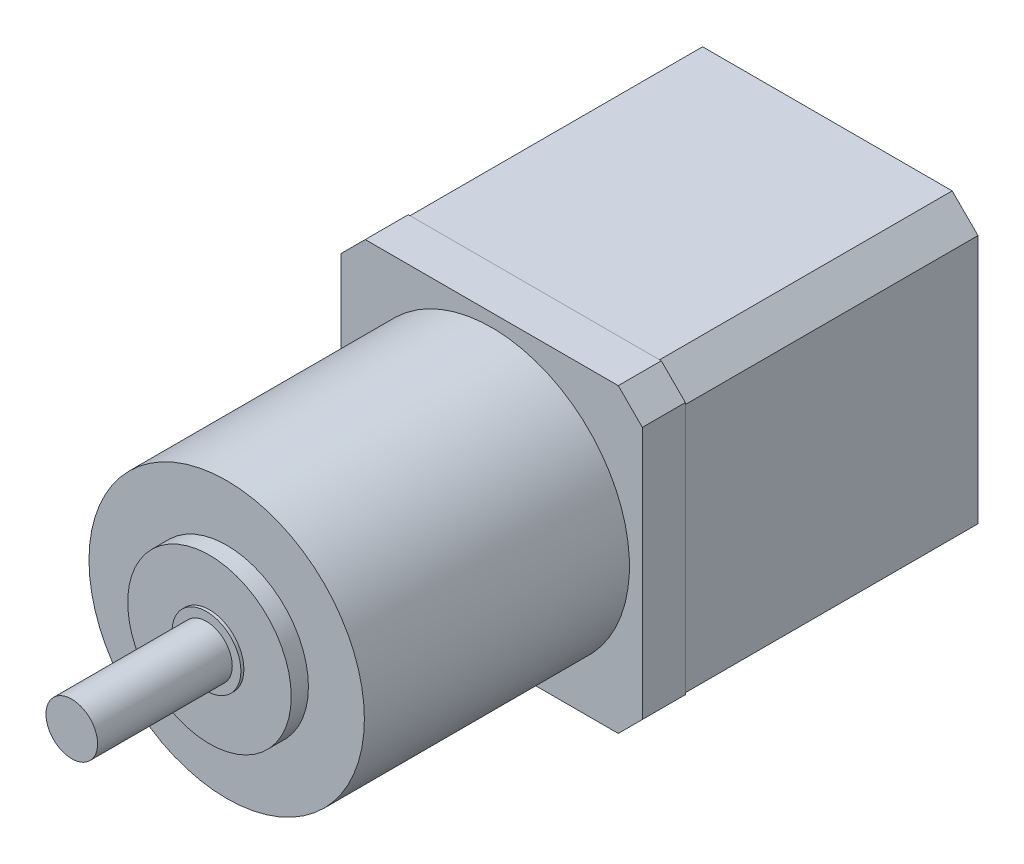
ISO-10303-21;
HEADER;
FILE_DESCRIPTION(('STEP AP214'),'2;1');
FILE_NAME('part.step','',(''),(''),'','','');
FILE_SCHEMA(('AUTOMOTIVE_DESIGN { 1 0 10303 214 1 1 1 1 }'));
ENDSEC;
DATA;
#1=APPLICATION_CONTEXT('core data for automotive mechanical design processes');
#2=APPLICATION_PROTOCOL_DEFINITION('international standard','automotive_design',2000,#1);
#3=PRODUCT_CONTEXT('',#1,'mechanical');
#4=PRODUCT('Part','Part','',(#3));
#5=PRODUCT_RELATED_PRODUCT_CATEGORY('part','',(#4));
#6=PRODUCT_DEFINITION_FORMATION('','',#4);
#7=PRODUCT_DEFINITION_CONTEXT('part definition',#1,'design');
#8=PRODUCT_DEFINITION('design','',#6,#7);
#9=PRODUCT_DEFINITION_SHAPE('','',#8);
#10=(LENGTH_UNIT() NAMED_UNIT(*) SI_UNIT(.MILLI.,.METRE.));
#11=(NAMED_UNIT(*) PLANE_ANGLE_UNIT() SI_UNIT($,.RADIAN.));
#12=(NAMED_UNIT(*) SI_UNIT($,.STERADIAN.) SOLID_ANGLE_UNIT());
#13=UNCERTAINTY_MEASURE_WITH_UNIT(LENGTH_MEASURE(1.E-05),#10,'distance_accuracy_value','');
#14=(GEOMETRIC_REPRESENTATION_CONTEXT(3) GLOBAL_UNCERTAINTY_ASSIGNED_CONTEXT((#13)) GLOBAL_UNIT_ASSIGNED_CONTEXT((#10,
#11,#12)) REPRESENTATION_CONTEXT('',''));
#15=CARTESIAN_POINT('',(0.,0.,0.));
#16=DIRECTION('',(0.,0.,1.));
#17=DIRECTION('',(1.,0.,0.));
#18=AXIS2_PLACEMENT_3D('',#15,#16,#17);
#19=CARTESIAN_POINT('',(17.5,-17.5,39.));
#20=DIRECTION('',(-1.,0.,0.));
#21=DIRECTION('',(0.,0.,1.));
#22=AXIS2_PLACEMENT_3D('',#19,#20,#21);
#23=PLANE('',#22);
#24=DIRECTION('',(0.,1.,0.));
#25=VECTOR('',#24,1.);
#26=CARTESIAN_POINT('',(17.5,-17.5,39.));
#27=LINE('',#26,#25);
#28=CARTESIAN_POINT('',(17.5,-14.7,39.));
#29=VERTEX_POINT('',#28);
#30=CARTESIAN_POINT('',(17.5,14.7,39.));
#31=VERTEX_POINT('',#30);
#32=EDGE_CURVE('E139',#29,#31,#27,.T.);
#33=ORIENTED_EDGE('',*,*,#32,.F.);
#34=DIRECTION('',(0.,0.,-1.));
#35=VECTOR('',#34,1.);
#36=CARTESIAN_POINT('',(17.5,-14.7,39.));
#37=LINE('',#36,#35);
#38=CARTESIAN_POINT('',(17.5,-14.7,34.));
#39=VERTEX_POINT('',#38);
#40=EDGE_CURVE('E165',#29,#39,#37,.T.);
#41=ORIENTED_EDGE('',*,*,#40,.T.);
#42=DIRECTION('',(0.,1.,0.));
#43=VECTOR('',#42,1.);
#44=CARTESIAN_POINT('',(17.5,-17.5,34.));
#45=LINE('',#44,#43);
#46=CARTESIAN_POINT('',(17.5,14.7,34.));
#47=VERTEX_POINT('',#46);
#48=EDGE_CURVE('E176',#39,#47,#45,.T.);
#49=ORIENTED_EDGE('',*,*,#48,.T.);
#50=DIRECTION('',(0.,0.,1.));
#51=VECTOR('',#50,1.);
#52=CARTESIAN_POINT('',(17.5,14.7,39.));
#53=LINE('',#52,#51);
#54=EDGE_CURVE('E163',#47,#31,#53,.T.);
#55=ORIENTED_EDGE('',*,*,#54,.T.);
#56=EDGE_LOOP('',(#33,#41,#49,#55));
#57=FACE_BOUND('',#56,.T.);
#58=ADVANCED_FACE('F46',(#57),#23,.F.);
#59=CARTESIAN_POINT('',(-17.5,17.5,39.));
#60=DIRECTION('',(0.,-1.,0.));
#61=DIRECTION('',(0.,0.,-1.));
#62=AXIS2_PLACEMENT_3D('',#59,#60,#61);
#63=PLANE('',#62);
#64=DIRECTION('',(-1.,0.,0.));
#65=VECTOR('',#64,1.);
#66=CARTESIAN_POINT('',(-17.5,17.5,34.));
#67=LINE('',#66,#65);
#68=CARTESIAN_POINT('',(14.7,17.5,34.));
#69=VERTEX_POINT('',#68);
#70=CARTESIAN_POINT('',(-14.7,17.5,34.));
#71=VERTEX_POINT('',#70);
#72=EDGE_CURVE('E144',#69,#71,#67,.T.);
#73=ORIENTED_EDGE('',*,*,#72,.T.);
#74=DIRECTION('',(0.,0.,1.));
#75=VECTOR('',#74,1.);
#76=CARTESIAN_POINT('',(-14.7,17.5,39.));
#77=LINE('',#76,#75);
#78=CARTESIAN_POINT('',(-14.7,17.5,39.));
#79=VERTEX_POINT('',#78);
#80=EDGE_CURVE('E55',#71,#79,#77,.T.);
#81=ORIENTED_EDGE('',*,*,#80,.T.);
#82=DIRECTION('',(-1.,0.,0.));
#83=VECTOR('',#82,1.);
#84=CARTESIAN_POINT('',(-17.5,17.5,39.));
#85=LINE('',#84,#83);
#86=CARTESIAN_POINT('',(14.7,17.5,39.));
#87=VERTEX_POINT('',#86);
#88=EDGE_CURVE('E142',#87,#79,#85,.T.);
#89=ORIENTED_EDGE('',*,*,#88,.F.);
#90=DIRECTION('',(0.,0.,-1.));
#91=VECTOR('',#90,1.);
#92=CARTESIAN_POINT('',(14.7,17.5,39.));
#93=LINE('',#92,#91);
#94=EDGE_CURVE('E168',#87,#69,#93,.T.);
#95=ORIENTED_EDGE('',*,*,#94,.T.);
#96=EDGE_LOOP('',(#73,#81,#89,#95));
#97=FACE_BOUND('',#96,.T.);
#98=ADVANCED_FACE('F173',(#97),#63,.F.);
#99=CARTESIAN_POINT('',(-17.5,-17.5,39.));
#100=DIRECTION('',(1.,0.,0.));
#101=DIRECTION('',(0.,0.,-1.));
#102=AXIS2_PLACEMENT_3D('',#99,#100,#101);
#103=PLANE('',#102);
#104=DIRECTION('',(0.,-1.,0.));
#105=VECTOR('',#104,1.);
#106=CARTESIAN_POINT('',(-17.5,-17.5,34.));
#107=LINE('',#106,#105);
#108=CARTESIAN_POINT('',(-17.5,14.7,34.));
#109=VERTEX_POINT('',#108);
#110=CARTESIAN_POINT('',(-17.5,-14.7,34.));
#111=VERTEX_POINT('',#110);
#112=EDGE_CURVE('E140',#109,#111,#107,.T.);
#113=ORIENTED_EDGE('',*,*,#112,.T.);
#114=DIRECTION('',(0.,0.,1.));
#115=VECTOR('',#114,1.);
#116=CARTESIAN_POINT('',(-17.5,-14.7,39.));
#117=LINE('',#116,#115);
#118=CARTESIAN_POINT('',(-17.5,-14.7,39.));
#119=VERTEX_POINT('',#118);
#120=EDGE_CURVE('E118',#111,#119,#117,.T.);
#121=ORIENTED_EDGE('',*,*,#120,.T.);
#122=DIRECTION('',(0.,-1.,0.));
#123=VECTOR('',#122,1.);
#124=CARTESIAN_POINT('',(-17.5,-17.5,39.));
#125=LINE('',#124,#123);
#126=CARTESIAN_POINT('',(-17.5,14.7,39.));
#127=VERTEX_POINT('',#126);
#128=EDGE_CURVE('E181',#127,#119,#125,.T.);
#129=ORIENTED_EDGE('',*,*,#128,.F.);
#130=DIRECTION('',(0.,0.,-1.));
#131=VECTOR('',#130,1.);
#132=CARTESIAN_POINT('',(-17.5,14.7,39.));
#133=LINE('',#132,#131);
#134=EDGE_CURVE('E123',#127,#109,#133,.T.);
#135=ORIENTED_EDGE('',*,*,#134,.T.);
#136=EDGE_LOOP('',(#113,#121,#129,#135));
#137=FACE_BOUND('',#136,.T.);
#138=ADVANCED_FACE('F229',(#137),#103,.F.);
#139=CARTESIAN_POINT('',(-17.5,-17.5,39.));
#140=DIRECTION('',(0.,1.,0.));
#141=DIRECTION('',(0.,0.,1.));
#142=AXIS2_PLACEMENT_3D('',#139,#140,#141);
#143=PLANE('',#142);
#144=DIRECTION('',(1.,0.,0.));
#145=VECTOR('',#144,1.);
#146=CARTESIAN_POINT('',(-17.5,-17.5,39.));
#147=LINE('',#146,#145);
#148=CARTESIAN_POINT('',(-14.7,-17.5,39.));
#149=VERTEX_POINT('',#148);
#150=CARTESIAN_POINT('',(14.7,-17.5,39.));
#151=VERTEX_POINT('',#150);
#152=EDGE_CURVE('E133',#149,#151,#147,.T.);
#153=ORIENTED_EDGE('',*,*,#152,.F.);
#154=DIRECTION('',(0.,0.,-1.));
#155=VECTOR('',#154,1.);
#156=CARTESIAN_POINT('',(-14.7,-17.5,39.));
#157=LINE('',#156,#155);
#158=CARTESIAN_POINT('',(-14.7,-17.5,34.));
#159=VERTEX_POINT('',#158);
#160=EDGE_CURVE('E117',#149,#159,#157,.T.);
#161=ORIENTED_EDGE('',*,*,#160,.T.);
#162=DIRECTION('',(1.,0.,0.));
#163=VECTOR('',#162,1.);
#164=CARTESIAN_POINT('',(-17.5,-17.5,34.));
#165=LINE('',#164,#163);
#166=CARTESIAN_POINT('',(14.7,-17.5,34.));
#167=VERTEX_POINT('',#166);
#168=EDGE_CURVE('E130',#159,#167,#165,.T.);
#169=ORIENTED_EDGE('',*,*,#168,.T.);
#170=DIRECTION('',(0.,0.,1.));
#171=VECTOR('',#170,1.);
#172=CARTESIAN_POINT('',(14.7,-17.5,39.));
#173=LINE('',#172,#171);
#174=EDGE_CURVE('E135',#167,#151,#173,.T.);
#175=ORIENTED_EDGE('',*,*,#174,.T.);
#176=EDGE_LOOP('',(#153,#161,#169,#175));
#177=FACE_BOUND('',#176,.T.);
#178=ADVANCED_FACE('F129',(#177),#143,.F.);
#179=CARTESIAN_POINT('',(0.,0.,39.));
#180=DIRECTION('',(0.,0.,-1.));
#181=DIRECTION('',(-1.,0.,0.));
#182=AXIS2_PLACEMENT_3D('',#179,#180,#181);
#183=PLANE('',#182);
#184=CARTESIAN_POINT('',(0.,0.,39.));
#185=DIRECTION('',(0.,0.,-1.));
#186=DIRECTION('',(-1.,0.,0.));
#187=AXIS2_PLACEMENT_3D('',#184,#185,#186);
#188=CIRCLE('',#187,16.);
#189=CARTESIAN_POINT('',(-16.,0.,39.));
#190=VERTEX_POINT('',#189);
#191=EDGE_CURVE('E12',#190,#190,#188,.F.);
#192=ORIENTED_EDGE('',*,*,#191,.F.);
#193=EDGE_LOOP('',(#192));
#194=FACE_BOUND('',#193,.T.);
#195=ORIENTED_EDGE('',*,*,#128,.T.);
#196=DIRECTION('',(-0.707106781186547,0.707106781186548,0.));
#197=VECTOR('',#196,1.);
#198=CARTESIAN_POINT('',(-14.7,-17.5,39.));
#199=LINE('',#198,#197);
#200=EDGE_CURVE('E161',#119,#149,#199,.F.);
#201=ORIENTED_EDGE('',*,*,#200,.T.);
#202=ORIENTED_EDGE('',*,*,#152,.T.);
#203=DIRECTION('',(-0.707106781186548,-0.707106781186547,0.));
#204=VECTOR('',#203,1.);
#205=CARTESIAN_POINT('',(17.5,-14.7,39.));
#206=LINE('',#205,#204);
#207=EDGE_CURVE('E159',#151,#29,#206,.F.);
#208=ORIENTED_EDGE('',*,*,#207,.T.);
#209=ORIENTED_EDGE('',*,*,#32,.T.);
#210=DIRECTION('',(0.707106781186547,-0.707106781186548,0.));
#211=VECTOR('',#210,1.);
#212=CARTESIAN_POINT('',(14.7,17.5,39.));
#213=LINE('',#212,#211);
#214=EDGE_CURVE('E68',#31,#87,#213,.F.);
#215=ORIENTED_EDGE('',*,*,#214,.T.);
#216=ORIENTED_EDGE('',*,*,#88,.T.);
#217=DIRECTION('',(0.707106781186548,0.707106781186547,0.));
#218=VECTOR('',#217,1.);
#219=CARTESIAN_POINT('',(-17.5,14.7,39.));
#220=LINE('',#219,#218);
#221=EDGE_CURVE('E157',#79,#127,#220,.F.);
#222=ORIENTED_EDGE('',*,*,#221,.T.);
#223=EDGE_LOOP('',(#195,#201,#202,#208,#209,#215,#216,#222));
#224=FACE_BOUND('',#223,.T.);
#225=ADVANCED_FACE('F249',(#194,#224),#183,.F.);
#226=CARTESIAN_POINT('',(0.,0.,34.));
#227=DIRECTION('',(0.,0.,-1.));
#228=DIRECTION('',(-1.,0.,0.));
#229=AXIS2_PLACEMENT_3D('',#226,#227,#228);
#230=PLANE('',#229);
#231=ORIENTED_EDGE('',*,*,#168,.F.);
#232=DIRECTION('',(0.707106781186547,-0.707106781186548,0.));
#233=VECTOR('',#232,1.);
#234=CARTESIAN_POINT('',(-16.1,-16.1,34.));
#235=LINE('',#234,#233);
#236=EDGE_CURVE('E113',#159,#111,#235,.F.);
#237=ORIENTED_EDGE('',*,*,#236,.T.);
#238=ORIENTED_EDGE('',*,*,#112,.F.);
#239=DIRECTION('',(-0.707106781186548,-0.707106781186547,0.));
#240=VECTOR('',#239,1.);
#241=CARTESIAN_POINT('',(-16.1,16.1,34.));
#242=LINE('',#241,#240);
#243=EDGE_CURVE('E150',#109,#71,#242,.F.);
#244=ORIENTED_EDGE('',*,*,#243,.T.);
#245=ORIENTED_EDGE('',*,*,#72,.F.);
#246=DIRECTION('',(-0.707106781186547,0.707106781186548,0.));
#247=VECTOR('',#246,1.);
#248=CARTESIAN_POINT('',(16.1,16.1,34.));
#249=LINE('',#248,#247);
#250=EDGE_CURVE('E134',#69,#47,#249,.F.);
#251=ORIENTED_EDGE('',*,*,#250,.T.);
#252=ORIENTED_EDGE('',*,*,#48,.F.);
#253=DIRECTION('',(0.707106781186548,0.707106781186547,0.));
#254=VECTOR('',#253,1.);
#255=CARTESIAN_POINT('',(16.1,-16.1,34.));
#256=LINE('',#255,#254);
#257=EDGE_CURVE('E124',#39,#167,#256,.F.);
#258=ORIENTED_EDGE('',*,*,#257,.T.);
#259=EDGE_LOOP('',(#231,#237,#238,#244,#245,#251,#252,#258));
#260=FACE_BOUND('',#259,.T.);
#261=ADVANCED_FACE('F137',(#260),#230,.T.);
#262=CARTESIAN_POINT('',(-14.7,-17.5,39.));
#263=DIRECTION('',(0.707106781186548,0.707106781186547,0.));
#264=DIRECTION('',(0.,0.,-1.));
#265=AXIS2_PLACEMENT_3D('',#262,#263,#264);
#266=PLANE('',#265);
#267=ORIENTED_EDGE('',*,*,#200,.F.);
#268=ORIENTED_EDGE('',*,*,#120,.F.);
#269=ORIENTED_EDGE('',*,*,#236,.F.);
#270=ORIENTED_EDGE('',*,*,#160,.F.);
#271=EDGE_LOOP('',(#267,#268,#269,#270));
#272=FACE_BOUND('',#271,.T.);
#273=ADVANCED_FACE('F116',(#272),#266,.F.);
#274=CARTESIAN_POINT('',(17.5,-14.7,39.));
#275=DIRECTION('',(-0.707106781186547,0.707106781186548,0.));
#276=DIRECTION('',(0.,0.,-1.));
#277=AXIS2_PLACEMENT_3D('',#274,#275,#276);
#278=PLANE('',#277);
#279=ORIENTED_EDGE('',*,*,#207,.F.);
#280=ORIENTED_EDGE('',*,*,#174,.F.);
#281=ORIENTED_EDGE('',*,*,#257,.F.);
#282=ORIENTED_EDGE('',*,*,#40,.F.);
#283=EDGE_LOOP('',(#279,#280,#281,#282));
#284=FACE_BOUND('',#283,.T.);
#285=ADVANCED_FACE('F236',(#284),#278,.F.);
#286=CARTESIAN_POINT('',(-17.5,14.7,39.));
#287=DIRECTION('',(0.707106781186547,-0.707106781186548,0.));
#288=DIRECTION('',(0.,0.,-1.));
#289=AXIS2_PLACEMENT_3D('',#286,#287,#288);
#290=PLANE('',#289);
#291=ORIENTED_EDGE('',*,*,#221,.F.);
#292=ORIENTED_EDGE('',*,*,#80,.F.);
#293=ORIENTED_EDGE('',*,*,#243,.F.);
#294=ORIENTED_EDGE('',*,*,#134,.F.);
#295=EDGE_LOOP('',(#291,#292,#293,#294));
#296=FACE_BOUND('',#295,.T.);
#297=ADVANCED_FACE('F238',(#296),#290,.F.);
#298=CARTESIAN_POINT('',(14.7,17.5,39.));
#299=DIRECTION('',(-0.707106781186548,-0.707106781186547,0.));
#300=DIRECTION('',(0.,0.,-1.));
#301=AXIS2_PLACEMENT_3D('',#298,#299,#300);
#302=PLANE('',#301);
#303=ORIENTED_EDGE('',*,*,#214,.F.);
#304=ORIENTED_EDGE('',*,*,#54,.F.);
#305=ORIENTED_EDGE('',*,*,#250,.F.);
#306=ORIENTED_EDGE('',*,*,#94,.F.);
#307=EDGE_LOOP('',(#303,#304,#305,#306));
#308=FACE_BOUND('',#307,.T.);
#309=ADVANCED_FACE('F48',(#308),#302,.F.);
#310=CARTESIAN_POINT('',(0.,0.,69.8));
#311=DIRECTION('',(0.,0.,-1.));
#312=DIRECTION('',(-1.,0.,0.));
#313=AXIS2_PLACEMENT_3D('',#310,#311,#312);
#314=CYLINDRICAL_SURFACE('',#313,16.);
#315=CARTESIAN_POINT('',(0.,0.,69.8));
#316=DIRECTION('',(0.,0.,1.));
#317=DIRECTION('',(1.,0.,0.));
#318=AXIS2_PLACEMENT_3D('',#315,#316,#317);
#319=CIRCLE('',#318,16.);
#320=CARTESIAN_POINT('',(16.,0.,69.8));
#321=VERTEX_POINT('',#320);
#322=EDGE_CURVE('E177',#321,#321,#319,.T.);
#323=ORIENTED_EDGE('',*,*,#322,.F.);
#324=EDGE_LOOP('',(#323));
#325=FACE_BOUND('',#324,.T.);
#326=ORIENTED_EDGE('',*,*,#191,.T.);
#327=EDGE_LOOP('',(#326));
#328=FACE_BOUND('',#327,.T.);
#329=ADVANCED_FACE('F245',(#325,#328),#314,.T.);
#330=CARTESIAN_POINT('',(0.,0.,69.8));
#331=DIRECTION('',(0.,0.,1.));
#332=DIRECTION('',(1.,0.,0.));
#333=AXIS2_PLACEMENT_3D('',#330,#331,#332);
#334=PLANE('',#333);
#335=CARTESIAN_POINT('',(0.,0.,69.8));
#336=DIRECTION('',(0.,0.,1.));
#337=DIRECTION('',(1.,0.,0.));
#338=AXIS2_PLACEMENT_3D('',#335,#336,#337);
#339=CIRCLE('',#338,9.5);
#340=CARTESIAN_POINT('',(9.5,0.,69.8));
#341=VERTEX_POINT('',#340);
#342=EDGE_CURVE('E188',#341,#341,#339,.T.);
#343=ORIENTED_EDGE('',*,*,#342,.F.);
#344=EDGE_LOOP('',(#343));
#345=FACE_BOUND('',#344,.T.);
#346=ORIENTED_EDGE('',*,*,#322,.T.);
#347=EDGE_LOOP('',(#346));
#348=FACE_BOUND('',#347,.T.);
#349=ADVANCED_FACE('F264',(#345,#348),#334,.T.);
#350=CARTESIAN_POINT('',(0.,0.,71.8));
#351=DIRECTION('',(0.,0.,-1.));
#352=DIRECTION('',(-1.,0.,0.));
#353=AXIS2_PLACEMENT_3D('',#350,#351,#352);
#354=CYLINDRICAL_SURFACE('',#353,9.5);
#355=CARTESIAN_POINT('',(0.,0.,71.8));
#356=DIRECTION('',(0.,0.,1.));
#357=DIRECTION('',(1.,0.,0.));
#358=AXIS2_PLACEMENT_3D('',#355,#356,#357);
#359=CIRCLE('',#358,9.5);
#360=CARTESIAN_POINT('',(9.5,0.,71.8));
#361=VERTEX_POINT('',#360);
#362=EDGE_CURVE('E187',#361,#361,#359,.T.);
#363=ORIENTED_EDGE('',*,*,#362,.F.);
#364=EDGE_LOOP('',(#363));
#365=FACE_BOUND('',#364,.T.);
#366=ORIENTED_EDGE('',*,*,#342,.T.);
#367=EDGE_LOOP('',(#366));
#368=FACE_BOUND('',#367,.T.);
#369=ADVANCED_FACE('F268',(#365,#368),#354,.T.);
#370=CARTESIAN_POINT('',(0.,0.,71.8));
#371=DIRECTION('',(0.,0.,1.));
#372=DIRECTION('',(1.,0.,0.));
#373=AXIS2_PLACEMENT_3D('',#370,#371,#372);
#374=PLANE('',#373);
#375=CARTESIAN_POINT('',(0.,0.,71.8));
#376=DIRECTION('',(0.,0.,1.));
#377=DIRECTION('',(1.,0.,0.));
#378=AXIS2_PLACEMENT_3D('',#375,#376,#377);
#379=CIRCLE('',#378,4.);
#380=CARTESIAN_POINT('',(4.,0.,71.8));
#381=VERTEX_POINT('',#380);
#382=EDGE_CURVE('E196',#381,#381,#379,.T.);
#383=ORIENTED_EDGE('',*,*,#382,.F.);
#384=EDGE_LOOP('',(#383));
#385=FACE_BOUND('',#384,.T.);
#386=ORIENTED_EDGE('',*,*,#362,.T.);
#387=EDGE_LOOP('',(#386));
#388=FACE_BOUND('',#387,.T.);
#389=ADVANCED_FACE('F220',(#385,#388),#374,.T.);
#390=CARTESIAN_POINT('',(0.,0.,72.15));
#391=DIRECTION('',(0.,0.,-1.));
#392=DIRECTION('',(-1.,0.,0.));
#393=AXIS2_PLACEMENT_3D('',#390,#391,#392);
#394=CYLINDRICAL_SURFACE('',#393,4.);
#395=CARTESIAN_POINT('',(0.,0.,72.15));
#396=DIRECTION('',(0.,0.,1.));
#397=DIRECTION('',(1.,0.,0.));
#398=AXIS2_PLACEMENT_3D('',#395,#396,#397);
#399=CIRCLE('',#398,4.);
#400=CARTESIAN_POINT('',(4.,0.,72.15));
#401=VERTEX_POINT('',#400);
#402=EDGE_CURVE('E199',#401,#401,#399,.T.);
#403=ORIENTED_EDGE('',*,*,#402,.F.);
#404=EDGE_LOOP('',(#403));
#405=FACE_BOUND('',#404,.T.);
#406=ORIENTED_EDGE('',*,*,#382,.T.);
#407=EDGE_LOOP('',(#406));
#408=FACE_BOUND('',#407,.T.);
#409=ADVANCED_FACE('F212',(#405,#408),#394,.T.);
#410=CARTESIAN_POINT('',(0.,0.,72.15));
#411=DIRECTION('',(0.,0.,1.));
#412=DIRECTION('',(1.,0.,0.));
#413=AXIS2_PLACEMENT_3D('',#410,#411,#412);
#414=PLANE('',#413);
#415=CARTESIAN_POINT('',(0.,0.,72.15));
#416=DIRECTION('',(0.,0.,1.));
#417=DIRECTION('',(1.,0.,0.));
#418=AXIS2_PLACEMENT_3D('',#415,#416,#417);
#419=CIRCLE('',#418,3.);
#420=CARTESIAN_POINT('',(3.,0.,72.15));
#421=VERTEX_POINT('',#420);
#422=EDGE_CURVE('E50',#421,#421,#419,.T.);
#423=ORIENTED_EDGE('',*,*,#422,.F.);
#424=EDGE_LOOP('',(#423));
#425=FACE_BOUND('',#424,.T.);
#426=ORIENTED_EDGE('',*,*,#402,.T.);
#427=EDGE_LOOP('',(#426));
#428=FACE_BOUND('',#427,.T.);
#429=ADVANCED_FACE('F209',(#425,#428),#414,.T.);
#430=CARTESIAN_POINT('',(0.,0.,87.8));
#431=DIRECTION('',(0.,0.,1.));
#432=DIRECTION('',(1.,0.,0.));
#433=AXIS2_PLACEMENT_3D('',#430,#431,#432);
#434=PLANE('',#433);
#435=CARTESIAN_POINT('',(0.,0.,87.8));
#436=DIRECTION('',(0.,0.,1.));
#437=DIRECTION('',(1.,0.,0.));
#438=AXIS2_PLACEMENT_3D('',#435,#436,#437);
#439=CIRCLE('',#438,3.);
#440=CARTESIAN_POINT('',(3.,0.,87.8));
#441=VERTEX_POINT('',#440);
#442=EDGE_CURVE('E191',#441,#441,#439,.T.);
#443=ORIENTED_EDGE('',*,*,#442,.T.);
#444=EDGE_LOOP('',(#443));
#445=FACE_BOUND('',#444,.T.);
#446=ADVANCED_FACE('F211',(#445),#434,.T.);
#447=CARTESIAN_POINT('',(0.,0.,87.8));
#448=DIRECTION('',(0.,0.,-1.));
#449=DIRECTION('',(-1.,0.,0.));
#450=AXIS2_PLACEMENT_3D('',#447,#448,#449);
#451=CYLINDRICAL_SURFACE('',#450,3.);
#452=ORIENTED_EDGE('',*,*,#422,.T.);
#453=EDGE_LOOP('',(#452));
#454=FACE_BOUND('',#453,.T.);
#455=ORIENTED_EDGE('',*,*,#442,.F.);
#456=EDGE_LOOP('',(#455));
#457=FACE_BOUND('',#456,.T.);
#458=ADVANCED_FACE('F206',(#454,#457),#451,.T.);
#459=CLOSED_SHELL('',(#58,#98,#138,#178,#225,#261,#273,#285,#297,#309,#329,#349,#369,#389,#409,
#429,#446,#458));
#460=MANIFOLD_SOLID_BREP('B2',#459);
#461=CARTESIAN_POINT('',(17.5,17.5,34.));
#462=DIRECTION('',(-1.,0.,0.));
#463=DIRECTION('',(0.,-1.,0.));
#464=AXIS2_PLACEMENT_3D('',#461,#462,#463);
#465=PLANE('',#464);
#466=DIRECTION('',(0.,1.,0.));
#467=VECTOR('',#466,1.);
#468=CARTESIAN_POINT('',(17.5,17.5,34.));
#469=LINE('',#468,#467);
#470=CARTESIAN_POINT('',(17.5,-14.5,34.));
#471=VERTEX_POINT('',#470);
#472=CARTESIAN_POINT('',(17.5,14.5,34.));
#473=VERTEX_POINT('',#472);
#474=EDGE_CURVE('E484',#471,#473,#469,.T.);
#475=ORIENTED_EDGE('',*,*,#474,.F.);
#476=DIRECTION('',(0.,0.,-1.));
#477=VECTOR('',#476,1.);
#478=CARTESIAN_POINT('',(17.5,-14.5,34.));
#479=LINE('',#478,#477);
#480=CARTESIAN_POINT('',(17.5,-14.5,0.));
#481=VERTEX_POINT('',#480);
#482=EDGE_CURVE('E510',#471,#481,#479,.T.);
#483=ORIENTED_EDGE('',*,*,#482,.T.);
#484=DIRECTION('',(0.,1.,0.));
#485=VECTOR('',#484,1.);
#486=CARTESIAN_POINT('',(17.5,17.5,0.));
#487=LINE('',#486,#485);
#488=CARTESIAN_POINT('',(17.5,14.5,0.));
#489=VERTEX_POINT('',#488);
#490=EDGE_CURVE('E518',#481,#489,#487,.T.);
#491=ORIENTED_EDGE('',*,*,#490,.T.);
#492=DIRECTION('',(0.,0.,1.));
#493=VECTOR('',#492,1.);
#494=CARTESIAN_POINT('',(17.5,14.5,34.));
#495=LINE('',#494,#493);
#496=EDGE_CURVE('E508',#489,#473,#495,.T.);
#497=ORIENTED_EDGE('',*,*,#496,.T.);
#498=EDGE_LOOP('',(#475,#483,#491,#497));
#499=FACE_BOUND('',#498,.T.);
#500=ADVANCED_FACE('F393',(#499),#465,.F.);
#501=CARTESIAN_POINT('',(-17.5,17.5,34.));
#502=DIRECTION('',(0.,-1.,0.));
#503=DIRECTION('',(0.,0.,-1.));
#504=AXIS2_PLACEMENT_3D('',#501,#502,#503);
#505=PLANE('',#504);
#506=DIRECTION('',(-1.,0.,0.));
#507=VECTOR('',#506,1.);
#508=CARTESIAN_POINT('',(-17.5,17.5,0.));
#509=LINE('',#508,#507);
#510=CARTESIAN_POINT('',(14.5,17.5,0.));
#511=VERTEX_POINT('',#510);
#512=CARTESIAN_POINT('',(-14.5,17.5,0.));
#513=VERTEX_POINT('',#512);
#514=EDGE_CURVE('E489',#511,#513,#509,.T.);
#515=ORIENTED_EDGE('',*,*,#514,.T.);
#516=DIRECTION('',(0.,0.,1.));
#517=VECTOR('',#516,1.);
#518=CARTESIAN_POINT('',(-14.5,17.5,34.));
#519=LINE('',#518,#517);
#520=CARTESIAN_POINT('',(-14.5,17.5,34.));
#521=VERTEX_POINT('',#520);
#522=EDGE_CURVE('E44',#513,#521,#519,.T.);
#523=ORIENTED_EDGE('',*,*,#522,.T.);
#524=DIRECTION('',(-1.,0.,0.));
#525=VECTOR('',#524,1.);
#526=CARTESIAN_POINT('',(-17.5,17.5,34.));
#527=LINE('',#526,#525);
#528=CARTESIAN_POINT('',(14.5,17.5,34.));
#529=VERTEX_POINT('',#528);
#530=EDGE_CURVE('E487',#529,#521,#527,.T.);
#531=ORIENTED_EDGE('',*,*,#530,.F.);
#532=DIRECTION('',(0.,0.,-1.));
#533=VECTOR('',#532,1.);
#534=CARTESIAN_POINT('',(14.5,17.5,34.));
#535=LINE('',#534,#533);
#536=EDGE_CURVE('E401',#529,#511,#535,.T.);
#537=ORIENTED_EDGE('',*,*,#536,.T.);
#538=EDGE_LOOP('',(#515,#523,#531,#537));
#539=FACE_BOUND('',#538,.T.);
#540=ADVANCED_FACE('F515',(#539),#505,.F.);
#541=CARTESIAN_POINT('',(-17.5,17.5,34.));
#542=DIRECTION('',(1.,0.,0.));
#543=DIRECTION('',(0.,1.,0.));
#544=AXIS2_PLACEMENT_3D('',#541,#542,#543);
#545=PLANE('',#544);
#546=DIRECTION('',(0.,-1.,0.));
#547=VECTOR('',#546,1.);
#548=CARTESIAN_POINT('',(-17.5,17.5,0.));
#549=LINE('',#548,#547);
#550=CARTESIAN_POINT('',(-17.5,14.5,0.));
#551=VERTEX_POINT('',#550);
#552=CARTESIAN_POINT('',(-17.5,-14.5,0.));
#553=VERTEX_POINT('',#552);
#554=EDGE_CURVE('E485',#551,#553,#549,.T.);
#555=ORIENTED_EDGE('',*,*,#554,.T.);
#556=DIRECTION('',(0.,0.,1.));
#557=VECTOR('',#556,1.);
#558=CARTESIAN_POINT('',(-17.5,-14.5,34.));
#559=LINE('',#558,#557);
#560=CARTESIAN_POINT('',(-17.5,-14.5,34.));
#561=VERTEX_POINT('',#560);
#562=EDGE_CURVE('E463',#553,#561,#559,.T.);
#563=ORIENTED_EDGE('',*,*,#562,.T.);
#564=DIRECTION('',(0.,-1.,0.));
#565=VECTOR('',#564,1.);
#566=CARTESIAN_POINT('',(-17.5,17.5,34.));
#567=LINE('',#566,#565);
#568=CARTESIAN_POINT('',(-17.5,14.5,34.));
#569=VERTEX_POINT('',#568);
#570=EDGE_CURVE('E522',#569,#561,#567,.T.);
#571=ORIENTED_EDGE('',*,*,#570,.F.);
#572=DIRECTION('',(0.,0.,-1.));
#573=VECTOR('',#572,1.);
#574=CARTESIAN_POINT('',(-17.5,14.5,34.));
#575=LINE('',#574,#573);
#576=EDGE_CURVE('E468',#569,#551,#575,.T.);
#577=ORIENTED_EDGE('',*,*,#576,.T.);
#578=EDGE_LOOP('',(#555,#563,#571,#577));
#579=FACE_BOUND('',#578,.T.);
#580=ADVANCED_FACE('F532',(#579),#545,.F.);
#581=CARTESIAN_POINT('',(-17.5,-17.5,34.));
#582=DIRECTION('',(0.,1.,0.));
#583=DIRECTION('',(0.,0.,1.));
#584=AXIS2_PLACEMENT_3D('',#581,#582,#583);
#585=PLANE('',#584);
#586=DIRECTION('',(1.,0.,0.));
#587=VECTOR('',#586,1.);
#588=CARTESIAN_POINT('',(-17.5,-17.5,34.));
#589=LINE('',#588,#587);
#590=CARTESIAN_POINT('',(-14.5,-17.5,34.));
#591=VERTEX_POINT('',#590);
#592=CARTESIAN_POINT('',(14.5,-17.5,34.));
#593=VERTEX_POINT('',#592);
#594=EDGE_CURVE('E478',#591,#593,#589,.T.);
#595=ORIENTED_EDGE('',*,*,#594,.F.);
#596=DIRECTION('',(0.,0.,-1.));
#597=VECTOR('',#596,1.);
#598=CARTESIAN_POINT('',(-14.5,-17.5,34.));
#599=LINE('',#598,#597);
#600=CARTESIAN_POINT('',(-14.5,-17.5,0.));
#601=VERTEX_POINT('',#600);
#602=EDGE_CURVE('E462',#591,#601,#599,.T.);
#603=ORIENTED_EDGE('',*,*,#602,.T.);
#604=DIRECTION('',(1.,0.,0.));
#605=VECTOR('',#604,1.);
#606=CARTESIAN_POINT('',(-17.5,-17.5,0.));
#607=LINE('',#606,#605);
#608=CARTESIAN_POINT('',(14.5,-17.5,0.));
#609=VERTEX_POINT('',#608);
#610=EDGE_CURVE('E475',#601,#609,#607,.T.);
#611=ORIENTED_EDGE('',*,*,#610,.T.);
#612=DIRECTION('',(0.,0.,1.));
#613=VECTOR('',#612,1.);
#614=CARTESIAN_POINT('',(14.5,-17.5,34.));
#615=LINE('',#614,#613);
#616=EDGE_CURVE('E480',#609,#593,#615,.T.);
#617=ORIENTED_EDGE('',*,*,#616,.T.);
#618=EDGE_LOOP('',(#595,#603,#611,#617));
#619=FACE_BOUND('',#618,.T.);
#620=ADVANCED_FACE('F474',(#619),#585,.F.);
#621=CARTESIAN_POINT('',(0.,0.,34.));
#622=DIRECTION('',(0.,0.,1.));
#623=DIRECTION('',(1.,0.,0.));
#624=AXIS2_PLACEMENT_3D('',#621,#622,#623);
#625=PLANE('',#624);
#626=ORIENTED_EDGE('',*,*,#570,.T.);
#627=DIRECTION('',(-0.707106781186546,0.707106781186549,0.));
#628=VECTOR('',#627,1.);
#629=CARTESIAN_POINT('',(-16.,-16.,34.));
#630=LINE('',#629,#628);
#631=EDGE_CURVE('E506',#561,#591,#630,.F.);
#632=ORIENTED_EDGE('',*,*,#631,.T.);
#633=ORIENTED_EDGE('',*,*,#594,.T.);
#634=DIRECTION('',(-0.70710678118655,-0.707106781186546,0.));
#635=VECTOR('',#634,1.);
#636=CARTESIAN_POINT('',(16.,-16.,34.));
#637=LINE('',#636,#635);
#638=EDGE_CURVE('E504',#593,#471,#637,.F.);
#639=ORIENTED_EDGE('',*,*,#638,.T.);
#640=ORIENTED_EDGE('',*,*,#474,.T.);
#641=DIRECTION('',(0.707106781186546,-0.707106781186549,0.));
#642=VECTOR('',#641,1.);
#643=CARTESIAN_POINT('',(16.,16.,34.));
#644=LINE('',#643,#642);
#645=EDGE_CURVE('E413',#473,#529,#644,.F.);
#646=ORIENTED_EDGE('',*,*,#645,.T.);
#647=ORIENTED_EDGE('',*,*,#530,.T.);
#648=DIRECTION('',(0.707106781186549,0.707106781186546,0.));
#649=VECTOR('',#648,1.);
#650=CARTESIAN_POINT('',(-16.,16.,34.));
#651=LINE('',#650,#649);
#652=EDGE_CURVE('E502',#521,#569,#651,.F.);
#653=ORIENTED_EDGE('',*,*,#652,.T.);
#654=EDGE_LOOP('',(#626,#632,#633,#639,#640,#646,#647,#653));
#655=FACE_BOUND('',#654,.T.);
#656=ADVANCED_FACE('F526',(#655),#625,.T.);
#657=CARTESIAN_POINT('',(0.,0.,0.));
#658=DIRECTION('',(0.,0.,1.));
#659=DIRECTION('',(1.,0.,0.));
#660=AXIS2_PLACEMENT_3D('',#657,#658,#659);
#661=PLANE('',#660);
#662=ORIENTED_EDGE('',*,*,#610,.F.);
#663=DIRECTION('',(0.707106781186546,-0.707106781186549,0.));
#664=VECTOR('',#663,1.);
#665=CARTESIAN_POINT('',(-14.5,-17.5,0.));
#666=LINE('',#665,#664);
#667=EDGE_CURVE('E458',#601,#553,#666,.F.);
#668=ORIENTED_EDGE('',*,*,#667,.T.);
#669=ORIENTED_EDGE('',*,*,#554,.F.);
#670=DIRECTION('',(-0.707106781186549,-0.707106781186546,0.));
#671=VECTOR('',#670,1.);
#672=CARTESIAN_POINT('',(-17.5,14.5,0.));
#673=LINE('',#672,#671);
#674=EDGE_CURVE('E495',#551,#513,#673,.F.);
#675=ORIENTED_EDGE('',*,*,#674,.T.);
#676=ORIENTED_EDGE('',*,*,#514,.F.);
#677=DIRECTION('',(-0.707106781186546,0.707106781186549,0.));
#678=VECTOR('',#677,1.);
#679=CARTESIAN_POINT('',(14.5,17.5,0.));
#680=LINE('',#679,#678);
#681=EDGE_CURVE('E479',#511,#489,#680,.F.);
#682=ORIENTED_EDGE('',*,*,#681,.T.);
#683=ORIENTED_EDGE('',*,*,#490,.F.);
#684=DIRECTION('',(0.70710678118655,0.707106781186546,0.));
#685=VECTOR('',#684,1.);
#686=CARTESIAN_POINT('',(17.5,-14.5,0.));
#687=LINE('',#686,#685);
#688=EDGE_CURVE('E469',#481,#609,#687,.F.);
#689=ORIENTED_EDGE('',*,*,#688,.T.);
#690=EDGE_LOOP('',(#662,#668,#669,#675,#676,#682,#683,#689));
#691=FACE_BOUND('',#690,.T.);
#692=ADVANCED_FACE('F482',(#691),#661,.F.);
#693=CARTESIAN_POINT('',(-14.5,-17.5,34.));
#694=DIRECTION('',(0.707106781186549,0.707106781186546,0.));
#695=DIRECTION('',(0.,0.,-1.));
#696=AXIS2_PLACEMENT_3D('',#693,#694,#695);
#697=PLANE('',#696);
#698=ORIENTED_EDGE('',*,*,#631,.F.);
#699=ORIENTED_EDGE('',*,*,#562,.F.);
#700=ORIENTED_EDGE('',*,*,#667,.F.);
#701=ORIENTED_EDGE('',*,*,#602,.F.);
#702=EDGE_LOOP('',(#698,#699,#700,#701));
#703=FACE_BOUND('',#702,.T.);
#704=ADVANCED_FACE('F461',(#703),#697,.F.);
#705=CARTESIAN_POINT('',(17.5,-14.5,34.));
#706=DIRECTION('',(-0.707106781186546,0.70710678118655,0.));
#707=DIRECTION('',(0.,0.,-1.));
#708=AXIS2_PLACEMENT_3D('',#705,#706,#707);
#709=PLANE('',#708);
#710=ORIENTED_EDGE('',*,*,#638,.F.);
#711=ORIENTED_EDGE('',*,*,#616,.F.);
#712=ORIENTED_EDGE('',*,*,#688,.F.);
#713=ORIENTED_EDGE('',*,*,#482,.F.);
#714=EDGE_LOOP('',(#710,#711,#712,#713));
#715=FACE_BOUND('',#714,.T.);
#716=ADVANCED_FACE('F537',(#715),#709,.F.);
#717=CARTESIAN_POINT('',(-17.5,14.5,34.));
#718=DIRECTION('',(0.707106781186546,-0.707106781186549,0.));
#719=DIRECTION('',(0.,0.,-1.));
#720=AXIS2_PLACEMENT_3D('',#717,#718,#719);
#721=PLANE('',#720);
#722=ORIENTED_EDGE('',*,*,#652,.F.);
#723=ORIENTED_EDGE('',*,*,#522,.F.);
#724=ORIENTED_EDGE('',*,*,#674,.F.);
#725=ORIENTED_EDGE('',*,*,#576,.F.);
#726=EDGE_LOOP('',(#722,#723,#724,#725));
#727=FACE_BOUND('',#726,.T.);
#728=ADVANCED_FACE('F530',(#727),#721,.F.);
#729=CARTESIAN_POINT('',(14.5,17.5,34.));
#730=DIRECTION('',(-0.707106781186549,-0.707106781186546,0.));
#731=DIRECTION('',(0.,0.,-1.));
#732=AXIS2_PLACEMENT_3D('',#729,#730,#731);
#733=PLANE('',#732);
#734=ORIENTED_EDGE('',*,*,#645,.F.);
#735=ORIENTED_EDGE('',*,*,#496,.F.);
#736=ORIENTED_EDGE('',*,*,#681,.F.);
#737=ORIENTED_EDGE('',*,*,#536,.F.);
#738=EDGE_LOOP('',(#734,#735,#736,#737));
#739=FACE_BOUND('',#738,.T.);
#740=ADVANCED_FACE('F395',(#739),#733,.F.);
#741=CLOSED_SHELL('',(#500,#540,#580,#620,#656,#692,#704,#716,#728,#740));
#742=MANIFOLD_SOLID_BREP('B6',#741);
#743=ADVANCED_BREP_SHAPE_REPRESENTATION('',(#18,#460,#742),#14);
#744=SHAPE_DEFINITION_REPRESENTATION(#9,#743);
ENDSEC;
END-ISO-10303-21;
